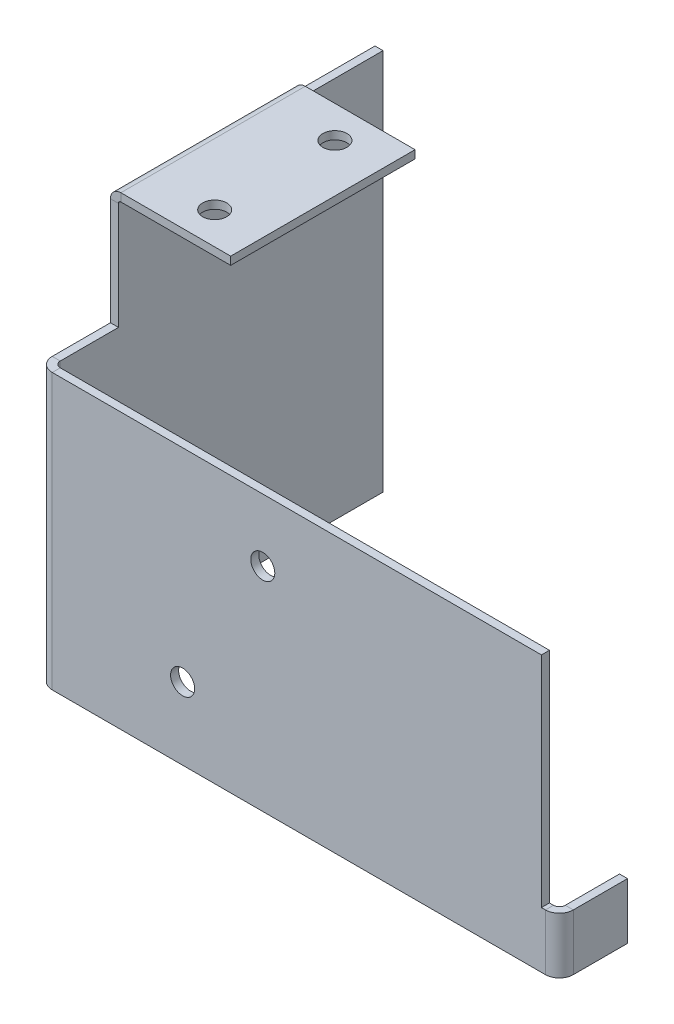
ISO-10303-21;
HEADER;
FILE_DESCRIPTION(('STEP AP214'),'2;1');
FILE_NAME('part.step','',(''),(''),'','','');
FILE_SCHEMA(('AUTOMOTIVE_DESIGN { 1 0 10303 214 1 1 1 1 }'));
ENDSEC;
DATA;
#1=APPLICATION_CONTEXT('core data for automotive mechanical design processes');
#2=APPLICATION_PROTOCOL_DEFINITION('international standard','automotive_design',2000,#1);
#3=PRODUCT_CONTEXT('',#1,'mechanical');
#4=PRODUCT('Part','Part','',(#3));
#5=PRODUCT_RELATED_PRODUCT_CATEGORY('part','',(#4));
#6=PRODUCT_DEFINITION_FORMATION('','',#4);
#7=PRODUCT_DEFINITION_CONTEXT('part definition',#1,'design');
#8=PRODUCT_DEFINITION('design','',#6,#7);
#9=PRODUCT_DEFINITION_SHAPE('','',#8);
#10=(LENGTH_UNIT() NAMED_UNIT(*) SI_UNIT(.MILLI.,.METRE.));
#11=(NAMED_UNIT(*) PLANE_ANGLE_UNIT() SI_UNIT($,.RADIAN.));
#12=(NAMED_UNIT(*) SI_UNIT($,.STERADIAN.) SOLID_ANGLE_UNIT());
#13=UNCERTAINTY_MEASURE_WITH_UNIT(LENGTH_MEASURE(1.E-05),#10,'distance_accuracy_value','');
#14=(GEOMETRIC_REPRESENTATION_CONTEXT(3) GLOBAL_UNCERTAINTY_ASSIGNED_CONTEXT((#13)) GLOBAL_UNIT_ASSIGNED_CONTEXT((#10,
#11,#12)) REPRESENTATION_CONTEXT('',''));
#15=CARTESIAN_POINT('',(0.,0.,0.));
#16=DIRECTION('',(0.,0.,1.));
#17=DIRECTION('',(1.,0.,0.));
#18=AXIS2_PLACEMENT_3D('',#15,#16,#17);
#19=CARTESIAN_POINT('',(50.,-49.0000000000001,32.0000000000002));
#20=DIRECTION('',(0.,1.,0.));
#21=DIRECTION('',(-1.,0.,0.));
#22=AXIS2_PLACEMENT_3D('',#19,#20,#21);
#23=PLANE('',#22);
#24=DIRECTION('',(0.,0.,1.));
#25=VECTOR('',#24,1.);
#26=CARTESIAN_POINT('',(48.2633999999999,-49.0000000000001,31.0000000000002));
#27=LINE('',#26,#25);
#28=CARTESIAN_POINT('',(48.2633999999999,-49.0000000000001,31.0000000000002));
#29=VERTEX_POINT('',#28);
#30=CARTESIAN_POINT('',(48.2634,-49.0000000000001,32.0000000000002));
#31=VERTEX_POINT('',#30);
#32=EDGE_CURVE('E301',#29,#31,#27,.T.);
#33=ORIENTED_EDGE('',*,*,#32,.T.);
#34=DIRECTION('',(1.,0.,0.));
#35=VECTOR('',#34,1.);
#36=CARTESIAN_POINT('',(-2.01358377817448E-13,-49.,32.));
#37=LINE('',#36,#35);
#38=CARTESIAN_POINT('',(-13.2634000000001,-49.,32.));
#39=VERTEX_POINT('',#38);
#40=EDGE_CURVE('E333',#39,#31,#37,.T.);
#41=ORIENTED_EDGE('',*,*,#40,.F.);
#42=DIRECTION('',(0.,0.,-1.));
#43=VECTOR('',#42,1.);
#44=CARTESIAN_POINT('',(-13.2634000000001,-49.,31.));
#45=LINE('',#44,#43);
#46=CARTESIAN_POINT('',(-13.2634000000001,-49.,31.));
#47=VERTEX_POINT('',#46);
#48=EDGE_CURVE('E343',#47,#39,#45,.F.);
#49=ORIENTED_EDGE('',*,*,#48,.F.);
#50=DIRECTION('',(-1.,0.,0.));
#51=VECTOR('',#50,1.);
#52=CARTESIAN_POINT('',(50.,-49.0000000000001,31.0000000000002));
#53=LINE('',#52,#51);
#54=EDGE_CURVE('E337',#47,#29,#53,.F.);
#55=ORIENTED_EDGE('',*,*,#54,.T.);
#56=EDGE_LOOP('',(#33,#41,#49,#55));
#57=FACE_BOUND('',#56,.T.);
#58=ADVANCED_FACE('F104',(#57),#23,.F.);
#59=CARTESIAN_POINT('',(-14.,-14.7,32.));
#60=DIRECTION('',(0.,-1.,0.));
#61=DIRECTION('',(1.,0.,0.));
#62=AXIS2_PLACEMENT_3D('',#59,#60,#61);
#63=PLANE('',#62);
#64=DIRECTION('',(0.,0.,1.));
#65=VECTOR('',#64,1.);
#66=CARTESIAN_POINT('',(47.7634,-14.7000000000001,32.));
#67=LINE('',#66,#65);
#68=CARTESIAN_POINT('',(47.7634,-14.7,31.0000000000002));
#69=VERTEX_POINT('',#68);
#70=CARTESIAN_POINT('',(47.7634,-14.7,32.0000000000002));
#71=VERTEX_POINT('',#70);
#72=EDGE_CURVE('E325',#69,#71,#67,.T.);
#73=ORIENTED_EDGE('',*,*,#72,.F.);
#74=DIRECTION('',(1.,0.,0.));
#75=VECTOR('',#74,1.);
#76=CARTESIAN_POINT('',(-14.,-14.7,31.));
#77=LINE('',#76,#75);
#78=CARTESIAN_POINT('',(-13.2634,-14.7,31.));
#79=VERTEX_POINT('',#78);
#80=EDGE_CURVE('E335',#69,#79,#77,.F.);
#81=ORIENTED_EDGE('',*,*,#80,.T.);
#82=DIRECTION('',(0.,0.,-1.));
#83=VECTOR('',#82,1.);
#84=CARTESIAN_POINT('',(-13.2634,-14.7,32.));
#85=LINE('',#84,#83);
#86=CARTESIAN_POINT('',(-13.2634,-14.7,32.));
#87=VERTEX_POINT('',#86);
#88=EDGE_CURVE('E329',#79,#87,#85,.F.);
#89=ORIENTED_EDGE('',*,*,#88,.T.);
#90=DIRECTION('',(-1.,0.,0.));
#91=VECTOR('',#90,1.);
#92=CARTESIAN_POINT('',(-1.39333882034983E-13,-14.7,32.));
#93=LINE('',#92,#91);
#94=EDGE_CURVE('E330',#71,#87,#93,.T.);
#95=ORIENTED_EDGE('',*,*,#94,.F.);
#96=EDGE_LOOP('',(#73,#81,#89,#95));
#97=FACE_BOUND('',#96,.T.);
#98=ADVANCED_FACE('F507',(#97),#63,.F.);
#99=CARTESIAN_POINT('',(-1.11044336849405E-13,0.,32.));
#100=DIRECTION('',(0.,0.,-1.));
#101=DIRECTION('',(-1.,0.,0.));
#102=AXIS2_PLACEMENT_3D('',#99,#100,#101);
#103=PLANE('',#102);
#104=CARTESIAN_POINT('',(3.,-40.,32.));
#105=DIRECTION('',(0.,0.,1.));
#106=DIRECTION('',(1.,0.,0.));
#107=AXIS2_PLACEMENT_3D('',#104,#105,#106);
#108=CIRCLE('',#107,1.5);
#109=CARTESIAN_POINT('',(4.5,-40.,32.));
#110=VERTEX_POINT('',#109);
#111=EDGE_CURVE('E453',#110,#110,#108,.T.);
#112=ORIENTED_EDGE('',*,*,#111,.F.);
#113=EDGE_LOOP('',(#112));
#114=FACE_BOUND('',#113,.T.);
#115=CARTESIAN_POINT('',(12.9999999999998,-22.5,32.));
#116=DIRECTION('',(0.,0.,1.));
#117=DIRECTION('',(1.,0.,0.));
#118=AXIS2_PLACEMENT_3D('',#115,#116,#117);
#119=CIRCLE('',#118,1.5);
#120=CARTESIAN_POINT('',(14.4999999999998,-22.5,32.));
#121=VERTEX_POINT('',#120);
#122=EDGE_CURVE('E458',#121,#121,#119,.T.);
#123=ORIENTED_EDGE('',*,*,#122,.F.);
#124=EDGE_LOOP('',(#123));
#125=FACE_BOUND('',#124,.T.);
#126=DIRECTION('',(0.,-1.,0.));
#127=VECTOR('',#126,1.);
#128=CARTESIAN_POINT('',(48.2633999999999,-49.0000000000001,32.0000000000002));
#129=LINE('',#128,#127);
#130=CARTESIAN_POINT('',(48.2634,-42.0000000000001,32.0000000000002));
#131=VERTEX_POINT('',#130);
#132=EDGE_CURVE('E294',#31,#131,#129,.F.);
#133=ORIENTED_EDGE('',*,*,#132,.T.);
#134=DIRECTION('',(1.,0.,0.));
#135=VECTOR('',#134,1.);
#136=CARTESIAN_POINT('',(-1.11044336849405E-13,-42.0000000000001,32.));
#137=LINE('',#136,#135);
#138=CARTESIAN_POINT('',(47.7634,-42.0000000000001,32.0000000000002));
#139=VERTEX_POINT('',#138);
#140=EDGE_CURVE('E327',#139,#131,#137,.T.);
#141=ORIENTED_EDGE('',*,*,#140,.F.);
#142=DIRECTION('',(0.,-1.,0.));
#143=VECTOR('',#142,1.);
#144=CARTESIAN_POINT('',(47.7634000000001,0.,32.0000000000002));
#145=LINE('',#144,#143);
#146=EDGE_CURVE('E320',#71,#139,#145,.T.);
#147=ORIENTED_EDGE('',*,*,#146,.F.);
#148=ORIENTED_EDGE('',*,*,#94,.T.);
#149=DIRECTION('',(0.,-1.,0.));
#150=VECTOR('',#149,1.);
#151=CARTESIAN_POINT('',(-13.2634,-14.7000000000001,32.));
#152=LINE('',#151,#150);
#153=EDGE_CURVE('E340',#39,#87,#152,.F.);
#154=ORIENTED_EDGE('',*,*,#153,.F.);
#155=ORIENTED_EDGE('',*,*,#40,.T.);
#156=EDGE_LOOP('',(#133,#141,#147,#148,#154,#155));
#157=FACE_BOUND('',#156,.T.);
#158=ADVANCED_FACE('F491',(#114,#125,#157),#103,.F.);
#159=CARTESIAN_POINT('',(-1.07703701030212E-13,0.,31.));
#160=DIRECTION('',(0.,0.,-1.));
#161=DIRECTION('',(-1.,0.,0.));
#162=AXIS2_PLACEMENT_3D('',#159,#160,#161);
#163=PLANE('',#162);
#164=CARTESIAN_POINT('',(3.,-40.,31.));
#165=DIRECTION('',(0.,0.,-1.));
#166=DIRECTION('',(-1.,0.,0.));
#167=AXIS2_PLACEMENT_3D('',#164,#165,#166);
#168=CIRCLE('',#167,1.5);
#169=CARTESIAN_POINT('',(1.5,-40.,31.));
#170=VERTEX_POINT('',#169);
#171=EDGE_CURVE('E108',#170,#170,#168,.T.);
#172=ORIENTED_EDGE('',*,*,#171,.F.);
#173=EDGE_LOOP('',(#172));
#174=FACE_BOUND('',#173,.T.);
#175=CARTESIAN_POINT('',(12.9999999999998,-22.5,31.0000000000001));
#176=DIRECTION('',(0.,0.,-1.));
#177=DIRECTION('',(-1.,0.,0.));
#178=AXIS2_PLACEMENT_3D('',#175,#176,#177);
#179=CIRCLE('',#178,1.5);
#180=CARTESIAN_POINT('',(11.4999999999998,-22.5,31.0000000000001));
#181=VERTEX_POINT('',#180);
#182=EDGE_CURVE('E451',#181,#181,#179,.T.);
#183=ORIENTED_EDGE('',*,*,#182,.F.);
#184=EDGE_LOOP('',(#183));
#185=FACE_BOUND('',#184,.T.);
#186=DIRECTION('',(-1.,0.,0.));
#187=VECTOR('',#186,1.);
#188=CARTESIAN_POINT('',(48.2634,-42.0000000000001,31.0000000000002));
#189=LINE('',#188,#187);
#190=CARTESIAN_POINT('',(48.2634,-42.0000000000001,31.0000000000002));
#191=VERTEX_POINT('',#190);
#192=CARTESIAN_POINT('',(47.7634,-42.0000000000001,31.0000000000002));
#193=VERTEX_POINT('',#192);
#194=EDGE_CURVE('E121',#191,#193,#189,.T.);
#195=ORIENTED_EDGE('',*,*,#194,.F.);
#196=DIRECTION('',(0.,-1.,0.));
#197=VECTOR('',#196,1.);
#198=CARTESIAN_POINT('',(48.2633999999999,-49.0000000000001,31.0000000000002));
#199=LINE('',#198,#197);
#200=EDGE_CURVE('E307',#29,#191,#199,.F.);
#201=ORIENTED_EDGE('',*,*,#200,.F.);
#202=ORIENTED_EDGE('',*,*,#54,.F.);
#203=DIRECTION('',(0.,-1.,0.));
#204=VECTOR('',#203,1.);
#205=CARTESIAN_POINT('',(-13.2634,-14.7000000000001,31.));
#206=LINE('',#205,#204);
#207=EDGE_CURVE('E346',#79,#47,#206,.T.);
#208=ORIENTED_EDGE('',*,*,#207,.F.);
#209=ORIENTED_EDGE('',*,*,#80,.F.);
#210=DIRECTION('',(0.,1.,0.));
#211=VECTOR('',#210,1.);
#212=CARTESIAN_POINT('',(47.7634,-42.0000000000001,31.0000000000002));
#213=LINE('',#212,#211);
#214=EDGE_CURVE('E321',#193,#69,#213,.T.);
#215=ORIENTED_EDGE('',*,*,#214,.F.);
#216=EDGE_LOOP('',(#195,#201,#202,#208,#209,#215));
#217=FACE_BOUND('',#216,.T.);
#218=ADVANCED_FACE('F499',(#174,#185,#217),#163,.T.);
#219=CARTESIAN_POINT('',(-15.,0.,0.));
#220=DIRECTION('',(-1.,0.,0.));
#221=DIRECTION('',(0.,-1.,0.));
#222=AXIS2_PLACEMENT_3D('',#219,#220,#221);
#223=PLANE('',#222);
#224=DIRECTION('',(0.,0.,-1.));
#225=VECTOR('',#224,1.);
#226=CARTESIAN_POINT('',(-15.0000000000002,-49.,0.));
#227=LINE('',#226,#225);
#228=CARTESIAN_POINT('',(-15.0000000000001,-49.,30.2634));
#229=VERTEX_POINT('',#228);
#230=CARTESIAN_POINT('',(-15.0000000000002,-49.,-10.));
#231=VERTEX_POINT('',#230);
#232=EDGE_CURVE('E393',#229,#231,#227,.T.);
#233=ORIENTED_EDGE('',*,*,#232,.F.);
#234=DIRECTION('',(0.,-1.,0.));
#235=VECTOR('',#234,1.);
#236=CARTESIAN_POINT('',(-15.0000000000001,-49.,30.2634));
#237=LINE('',#236,#235);
#238=CARTESIAN_POINT('',(-15.0000000000002,-14.7,30.2634));
#239=VERTEX_POINT('',#238);
#240=EDGE_CURVE('E350',#229,#239,#237,.F.);
#241=ORIENTED_EDGE('',*,*,#240,.T.);
#242=DIRECTION('',(0.,0.,-1.));
#243=VECTOR('',#242,1.);
#244=CARTESIAN_POINT('',(-15.0000000000002,-14.7,32.));
#245=LINE('',#244,#243);
#246=CARTESIAN_POINT('',(-15.,-14.7,23.));
#247=VERTEX_POINT('',#246);
#248=EDGE_CURVE('E129',#239,#247,#245,.T.);
#249=ORIENTED_EDGE('',*,*,#248,.T.);
#250=DIRECTION('',(0.,-1.,0.));
#251=VECTOR('',#250,1.);
#252=CARTESIAN_POINT('',(-15.0000000000002,-49.,23.));
#253=LINE('',#252,#251);
#254=CARTESIAN_POINT('',(-15.,-1.3,23.));
#255=VERTEX_POINT('',#254);
#256=EDGE_CURVE('E396',#255,#247,#253,.T.);
#257=ORIENTED_EDGE('',*,*,#256,.F.);
#258=DIRECTION('',(0.,0.,-1.));
#259=VECTOR('',#258,1.);
#260=CARTESIAN_POINT('',(-15.,-1.3,0.));
#261=LINE('',#260,#259);
#262=CARTESIAN_POINT('',(-15.,-1.3,0.));
#263=VERTEX_POINT('',#262);
#264=EDGE_CURVE('E403',#255,#263,#261,.T.);
#265=ORIENTED_EDGE('',*,*,#264,.T.);
#266=DIRECTION('',(0.,0.,-1.));
#267=VECTOR('',#266,1.);
#268=CARTESIAN_POINT('',(-15.,-1.3,0.));
#269=LINE('',#268,#267);
#270=CARTESIAN_POINT('',(-15.,-1.3,-10.));
#271=VERTEX_POINT('',#270);
#272=EDGE_CURVE('E377',#263,#271,#269,.T.);
#273=ORIENTED_EDGE('',*,*,#272,.T.);
#274=DIRECTION('',(0.,-1.,0.));
#275=VECTOR('',#274,1.);
#276=CARTESIAN_POINT('',(-15.0000000000002,-49.,-10.));
#277=LINE('',#276,#275);
#278=EDGE_CURVE('E384',#271,#231,#277,.T.);
#279=ORIENTED_EDGE('',*,*,#278,.T.);
#280=EDGE_LOOP('',(#233,#241,#249,#257,#265,#273,#279));
#281=FACE_BOUND('',#280,.T.);
#282=ADVANCED_FACE('F520',(#281),#223,.T.);
#283=CARTESIAN_POINT('',(-14.,0.,0.));
#284=DIRECTION('',(-1.,0.,0.));
#285=DIRECTION('',(0.,-1.,0.));
#286=AXIS2_PLACEMENT_3D('',#283,#284,#285);
#287=PLANE('',#286);
#288=DIRECTION('',(0.,-1.,0.));
#289=VECTOR('',#288,1.);
#290=CARTESIAN_POINT('',(-14.0000000000001,-49.,30.2634));
#291=LINE('',#290,#289);
#292=CARTESIAN_POINT('',(-14.0000000000001,-49.,30.2634));
#293=VERTEX_POINT('',#292);
#294=CARTESIAN_POINT('',(-14.,-14.7,30.2634));
#295=VERTEX_POINT('',#294);
#296=EDGE_CURVE('E362',#293,#295,#291,.F.);
#297=ORIENTED_EDGE('',*,*,#296,.F.);
#298=DIRECTION('',(0.,0.,1.));
#299=VECTOR('',#298,1.);
#300=CARTESIAN_POINT('',(-14.0000000000002,-49.,0.));
#301=LINE('',#300,#299);
#302=CARTESIAN_POINT('',(-14.0000000000002,-49.0000000000002,-10.));
#303=VERTEX_POINT('',#302);
#304=EDGE_CURVE('E398',#293,#303,#301,.F.);
#305=ORIENTED_EDGE('',*,*,#304,.T.);
#306=DIRECTION('',(0.,1.,0.));
#307=VECTOR('',#306,1.);
#308=CARTESIAN_POINT('',(-14.0000000000002,-49.,-10.));
#309=LINE('',#308,#307);
#310=CARTESIAN_POINT('',(-14.,-1.3,-10.));
#311=VERTEX_POINT('',#310);
#312=EDGE_CURVE('E378',#303,#311,#309,.T.);
#313=ORIENTED_EDGE('',*,*,#312,.T.);
#314=DIRECTION('',(0.,0.,1.));
#315=VECTOR('',#314,1.);
#316=CARTESIAN_POINT('',(-14.,-1.3,0.));
#317=LINE('',#316,#315);
#318=CARTESIAN_POINT('',(-14.,-1.3,0.));
#319=VERTEX_POINT('',#318);
#320=EDGE_CURVE('E380',#311,#319,#317,.T.);
#321=ORIENTED_EDGE('',*,*,#320,.T.);
#322=DIRECTION('',(0.,0.,1.));
#323=VECTOR('',#322,1.);
#324=CARTESIAN_POINT('',(-14.,-1.3,23.));
#325=LINE('',#324,#323);
#326=CARTESIAN_POINT('',(-14.,-1.3,23.));
#327=VERTEX_POINT('',#326);
#328=EDGE_CURVE('E409',#327,#319,#325,.F.);
#329=ORIENTED_EDGE('',*,*,#328,.F.);
#330=DIRECTION('',(0.,1.,0.));
#331=VECTOR('',#330,1.);
#332=CARTESIAN_POINT('',(-14.,0.,23.));
#333=LINE('',#332,#331);
#334=CARTESIAN_POINT('',(-14.,-14.7,23.));
#335=VERTEX_POINT('',#334);
#336=EDGE_CURVE('E400',#327,#335,#333,.F.);
#337=ORIENTED_EDGE('',*,*,#336,.T.);
#338=DIRECTION('',(0.,0.,-1.));
#339=VECTOR('',#338,1.);
#340=CARTESIAN_POINT('',(-14.,-14.7,32.));
#341=LINE('',#340,#339);
#342=EDGE_CURVE('E375',#295,#335,#341,.T.);
#343=ORIENTED_EDGE('',*,*,#342,.F.);
#344=EDGE_LOOP('',(#297,#305,#313,#321,#329,#337,#343));
#345=FACE_BOUND('',#344,.T.);
#346=ADVANCED_FACE('F531',(#345),#287,.F.);
#347=CARTESIAN_POINT('',(-15.0000000000002,-49.,0.));
#348=DIRECTION('',(0.,-1.,0.));
#349=DIRECTION('',(1.,0.,0.));
#350=AXIS2_PLACEMENT_3D('',#347,#348,#349);
#351=PLANE('',#350);
#352=ORIENTED_EDGE('',*,*,#304,.F.);
#353=DIRECTION('',(-1.,0.,0.));
#354=VECTOR('',#353,1.);
#355=CARTESIAN_POINT('',(-14.0000000000001,-49.,30.2634));
#356=LINE('',#355,#354);
#357=EDGE_CURVE('E356',#293,#229,#356,.T.);
#358=ORIENTED_EDGE('',*,*,#357,.T.);
#359=ORIENTED_EDGE('',*,*,#232,.T.);
#360=DIRECTION('',(-1.,0.,0.));
#361=VECTOR('',#360,1.);
#362=CARTESIAN_POINT('',(34.7369469704452,-49.0000000000002,-10.));
#363=LINE('',#362,#361);
#364=EDGE_CURVE('E381',#303,#231,#363,.T.);
#365=ORIENTED_EDGE('',*,*,#364,.F.);
#366=EDGE_LOOP('',(#352,#358,#359,#365));
#367=FACE_BOUND('',#366,.T.);
#368=ADVANCED_FACE('F526',(#367),#351,.T.);
#369=CARTESIAN_POINT('',(-15.0000000000002,-14.7,32.));
#370=DIRECTION('',(0.,-1.,0.));
#371=DIRECTION('',(0.,0.,-1.));
#372=AXIS2_PLACEMENT_3D('',#369,#370,#371);
#373=PLANE('',#372);
#374=DIRECTION('',(-1.,0.,0.));
#375=VECTOR('',#374,1.);
#376=CARTESIAN_POINT('',(-14.,-14.7,30.2634));
#377=LINE('',#376,#375);
#378=EDGE_CURVE('E366',#295,#239,#377,.T.);
#379=ORIENTED_EDGE('',*,*,#378,.F.);
#380=ORIENTED_EDGE('',*,*,#342,.T.);
#381=DIRECTION('',(-1.,0.,0.));
#382=VECTOR('',#381,1.);
#383=CARTESIAN_POINT('',(-15.0000000000002,-14.7,23.));
#384=LINE('',#383,#382);
#385=EDGE_CURVE('E369',#335,#247,#384,.T.);
#386=ORIENTED_EDGE('',*,*,#385,.T.);
#387=ORIENTED_EDGE('',*,*,#248,.F.);
#388=EDGE_LOOP('',(#379,#380,#386,#387));
#389=FACE_BOUND('',#388,.T.);
#390=ADVANCED_FACE('F517',(#389),#373,.F.);
#391=CARTESIAN_POINT('',(-15.0000000000002,-49.,23.));
#392=DIRECTION('',(0.,0.,1.));
#393=DIRECTION('',(1.,0.,0.));
#394=AXIS2_PLACEMENT_3D('',#391,#392,#393);
#395=PLANE('',#394);
#396=ORIENTED_EDGE('',*,*,#256,.T.);
#397=ORIENTED_EDGE('',*,*,#385,.F.);
#398=ORIENTED_EDGE('',*,*,#336,.F.);
#399=DIRECTION('',(-1.,0.,0.));
#400=VECTOR('',#399,1.);
#401=CARTESIAN_POINT('',(-15.,-1.29999999999999,23.));
#402=LINE('',#401,#400);
#403=EDGE_CURVE('E392',#327,#255,#402,.T.);
#404=ORIENTED_EDGE('',*,*,#403,.T.);
#405=EDGE_LOOP('',(#396,#397,#398,#404));
#406=FACE_BOUND('',#405,.T.);
#407=ADVANCED_FACE('F545',(#406),#395,.T.);
#408=CARTESIAN_POINT('',(0.,-1.,0.));
#409=DIRECTION('',(0.,0.,-1.));
#410=DIRECTION('',(-1.,0.,0.));
#411=AXIS2_PLACEMENT_3D('',#408,#409,#410);
#412=PLANE('',#411);
#413=DIRECTION('',(-1.,0.,0.));
#414=VECTOR('',#413,1.);
#415=CARTESIAN_POINT('',(0.,-1.,0.));
#416=LINE('',#415,#414);
#417=CARTESIAN_POINT('',(0.,-1.,0.));
#418=VERTEX_POINT('',#417);
#419=CARTESIAN_POINT('',(-13.7,-1.,0.));
#420=VERTEX_POINT('',#419);
#421=EDGE_CURVE('E439',#418,#420,#416,.T.);
#422=ORIENTED_EDGE('',*,*,#421,.T.);
#423=DIRECTION('',(0.,1.,0.));
#424=VECTOR('',#423,1.);
#425=CARTESIAN_POINT('',(-13.7,-1.,0.));
#426=LINE('',#425,#424);
#427=CARTESIAN_POINT('',(-13.7,0.,0.));
#428=VERTEX_POINT('',#427);
#429=EDGE_CURVE('E420',#420,#428,#426,.T.);
#430=ORIENTED_EDGE('',*,*,#429,.T.);
#431=DIRECTION('',(-1.,0.,0.));
#432=VECTOR('',#431,1.);
#433=CARTESIAN_POINT('',(0.,0.,0.));
#434=LINE('',#433,#432);
#435=CARTESIAN_POINT('',(0.,0.,0.));
#436=VERTEX_POINT('',#435);
#437=EDGE_CURVE('E447',#436,#428,#434,.T.);
#438=ORIENTED_EDGE('',*,*,#437,.F.);
#439=DIRECTION('',(0.,1.,0.));
#440=VECTOR('',#439,1.);
#441=CARTESIAN_POINT('',(0.,-1.,0.));
#442=LINE('',#441,#440);
#443=EDGE_CURVE('E113',#418,#436,#442,.T.);
#444=ORIENTED_EDGE('',*,*,#443,.F.);
#445=EDGE_LOOP('',(#422,#430,#438,#444));
#446=FACE_BOUND('',#445,.T.);
#447=ADVANCED_FACE('F569',(#446),#412,.T.);
#448=CARTESIAN_POINT('',(0.,-1.,0.));
#449=DIRECTION('',(0.,-1.,0.));
#450=DIRECTION('',(0.,0.,-1.));
#451=AXIS2_PLACEMENT_3D('',#448,#449,#450);
#452=PLANE('',#451);
#453=CARTESIAN_POINT('',(-6.,-0.999999999999999,4.));
#454=DIRECTION('',(0.,-1.,0.));
#455=DIRECTION('',(0.,0.,-1.));
#456=AXIS2_PLACEMENT_3D('',#453,#454,#455);
#457=CIRCLE('',#456,1.5);
#458=CARTESIAN_POINT('',(-6.,-0.999999999999999,2.5));
#459=VERTEX_POINT('',#458);
#460=EDGE_CURVE('E463',#459,#459,#457,.T.);
#461=ORIENTED_EDGE('',*,*,#460,.F.);
#462=EDGE_LOOP('',(#461));
#463=FACE_BOUND('',#462,.T.);
#464=CARTESIAN_POINT('',(-6.,-0.999999999999999,19.));
#465=DIRECTION('',(0.,-1.,0.));
#466=DIRECTION('',(0.,0.,-1.));
#467=AXIS2_PLACEMENT_3D('',#464,#465,#466);
#468=CIRCLE('',#467,1.5);
#469=CARTESIAN_POINT('',(-6.,-0.999999999999999,17.5));
#470=VERTEX_POINT('',#469);
#471=EDGE_CURVE('E1076',#470,#470,#468,.T.);
#472=ORIENTED_EDGE('',*,*,#471,.F.);
#473=EDGE_LOOP('',(#472));
#474=FACE_BOUND('',#473,.T.);
#475=DIRECTION('',(1.,0.,0.));
#476=VECTOR('',#475,1.);
#477=CARTESIAN_POINT('',(0.,-1.,23.));
#478=LINE('',#477,#476);
#479=CARTESIAN_POINT('',(-13.7,-1.,23.));
#480=VERTEX_POINT('',#479);
#481=CARTESIAN_POINT('',(0.,-1.,23.));
#482=VERTEX_POINT('',#481);
#483=EDGE_CURVE('E443',#480,#482,#478,.T.);
#484=ORIENTED_EDGE('',*,*,#483,.F.);
#485=DIRECTION('',(0.,0.,-1.));
#486=VECTOR('',#485,1.);
#487=CARTESIAN_POINT('',(-13.7,-1.,0.));
#488=LINE('',#487,#486);
#489=EDGE_CURVE('E426',#420,#480,#488,.F.);
#490=ORIENTED_EDGE('',*,*,#489,.F.);
#491=ORIENTED_EDGE('',*,*,#421,.F.);
#492=DIRECTION('',(0.,0.,-1.));
#493=VECTOR('',#492,1.);
#494=CARTESIAN_POINT('',(0.,-1.,0.));
#495=LINE('',#494,#493);
#496=EDGE_CURVE('E436',#482,#418,#495,.T.);
#497=ORIENTED_EDGE('',*,*,#496,.F.);
#498=EDGE_LOOP('',(#484,#490,#491,#497));
#499=FACE_BOUND('',#498,.T.);
#500=ADVANCED_FACE('F561',(#463,#474,#499),#452,.T.);
#501=CARTESIAN_POINT('',(0.,0.,0.));
#502=DIRECTION('',(0.,-1.,0.));
#503=DIRECTION('',(0.,0.,-1.));
#504=AXIS2_PLACEMENT_3D('',#501,#502,#503);
#505=PLANE('',#504);
#506=CARTESIAN_POINT('',(-6.,0.,4.));
#507=DIRECTION('',(0.,1.,0.));
#508=DIRECTION('',(0.,0.,1.));
#509=AXIS2_PLACEMENT_3D('',#506,#507,#508);
#510=CIRCLE('',#509,1.5);
#511=CARTESIAN_POINT('',(-6.,0.,5.5));
#512=VERTEX_POINT('',#511);
#513=EDGE_CURVE('E1075',#512,#512,#510,.T.);
#514=ORIENTED_EDGE('',*,*,#513,.F.);
#515=EDGE_LOOP('',(#514));
#516=FACE_BOUND('',#515,.T.);
#517=CARTESIAN_POINT('',(-6.,0.,19.));
#518=DIRECTION('',(0.,1.,0.));
#519=DIRECTION('',(0.,0.,1.));
#520=AXIS2_PLACEMENT_3D('',#517,#518,#519);
#521=CIRCLE('',#520,1.5);
#522=CARTESIAN_POINT('',(-6.,0.,20.5));
#523=VERTEX_POINT('',#522);
#524=EDGE_CURVE('E1077',#523,#523,#521,.T.);
#525=ORIENTED_EDGE('',*,*,#524,.F.);
#526=EDGE_LOOP('',(#525));
#527=FACE_BOUND('',#526,.T.);
#528=DIRECTION('',(0.,0.,-1.));
#529=VECTOR('',#528,1.);
#530=CARTESIAN_POINT('',(-13.7,0.,0.));
#531=LINE('',#530,#529);
#532=CARTESIAN_POINT('',(-13.7,0.,23.));
#533=VERTEX_POINT('',#532);
#534=EDGE_CURVE('E414',#428,#533,#531,.F.);
#535=ORIENTED_EDGE('',*,*,#534,.T.);
#536=DIRECTION('',(1.,0.,0.));
#537=VECTOR('',#536,1.);
#538=CARTESIAN_POINT('',(0.,0.,23.));
#539=LINE('',#538,#537);
#540=CARTESIAN_POINT('',(0.,0.,23.));
#541=VERTEX_POINT('',#540);
#542=EDGE_CURVE('E440',#533,#541,#539,.T.);
#543=ORIENTED_EDGE('',*,*,#542,.T.);
#544=DIRECTION('',(0.,0.,-1.));
#545=VECTOR('',#544,1.);
#546=CARTESIAN_POINT('',(0.,0.,0.));
#547=LINE('',#546,#545);
#548=EDGE_CURVE('E434',#541,#436,#547,.T.);
#549=ORIENTED_EDGE('',*,*,#548,.T.);
#550=ORIENTED_EDGE('',*,*,#437,.T.);
#551=EDGE_LOOP('',(#535,#543,#549,#550));
#552=FACE_BOUND('',#551,.T.);
#553=ADVANCED_FACE('F571',(#516,#527,#552),#505,.F.);
#554=CARTESIAN_POINT('',(0.,-1.,0.));
#555=DIRECTION('',(1.,0.,0.));
#556=DIRECTION('',(0.,0.,-1.));
#557=AXIS2_PLACEMENT_3D('',#554,#555,#556);
#558=PLANE('',#557);
#559=ORIENTED_EDGE('',*,*,#548,.F.);
#560=DIRECTION('',(0.,1.,0.));
#561=VECTOR('',#560,1.);
#562=CARTESIAN_POINT('',(0.,-1.,23.));
#563=LINE('',#562,#561);
#564=EDGE_CURVE('E13',#482,#541,#563,.T.);
#565=ORIENTED_EDGE('',*,*,#564,.F.);
#566=ORIENTED_EDGE('',*,*,#496,.T.);
#567=ORIENTED_EDGE('',*,*,#443,.T.);
#568=EDGE_LOOP('',(#559,#565,#566,#567));
#569=FACE_BOUND('',#568,.T.);
#570=ADVANCED_FACE('F106',(#569),#558,.T.);
#571=CARTESIAN_POINT('',(0.,-1.,23.));
#572=DIRECTION('',(0.,0.,1.));
#573=DIRECTION('',(1.,0.,0.));
#574=AXIS2_PLACEMENT_3D('',#571,#572,#573);
#575=PLANE('',#574);
#576=DIRECTION('',(0.,1.,0.));
#577=VECTOR('',#576,1.);
#578=CARTESIAN_POINT('',(-13.7,-1.,23.));
#579=LINE('',#578,#577);
#580=EDGE_CURVE('E431',#480,#533,#579,.T.);
#581=ORIENTED_EDGE('',*,*,#580,.F.);
#582=ORIENTED_EDGE('',*,*,#483,.T.);
#583=ORIENTED_EDGE('',*,*,#564,.T.);
#584=ORIENTED_EDGE('',*,*,#542,.F.);
#585=EDGE_LOOP('',(#581,#582,#583,#584));
#586=FACE_BOUND('',#585,.T.);
#587=ADVANCED_FACE('F557',(#586),#575,.T.);
#588=CARTESIAN_POINT('',(-13.7,-1.3,23.));
#589=DIRECTION('',(0.,0.,1.));
#590=DIRECTION('',(1.,0.,0.));
#591=AXIS2_PLACEMENT_3D('',#588,#589,#590);
#592=PLANE('',#591);
#593=ORIENTED_EDGE('',*,*,#403,.F.);
#594=CARTESIAN_POINT('',(-13.7,-1.3,23.));
#595=DIRECTION('',(0.,0.,-1.));
#596=DIRECTION('',(-1.,0.,0.));
#597=AXIS2_PLACEMENT_3D('',#594,#595,#596);
#598=CIRCLE('',#597,0.299999999999998);
#599=EDGE_CURVE('E423',#480,#327,#598,.F.);
#600=ORIENTED_EDGE('',*,*,#599,.F.);
#601=ORIENTED_EDGE('',*,*,#580,.T.);
#602=CARTESIAN_POINT('',(-13.7,-1.3,23.));
#603=DIRECTION('',(0.,0.,-1.));
#604=DIRECTION('',(-1.,0.,0.));
#605=AXIS2_PLACEMENT_3D('',#602,#603,#604);
#606=CIRCLE('',#605,1.3);
#607=EDGE_CURVE('E416',#533,#255,#606,.F.);
#608=ORIENTED_EDGE('',*,*,#607,.T.);
#609=EDGE_LOOP('',(#593,#600,#601,#608));
#610=FACE_BOUND('',#609,.T.);
#611=ADVANCED_FACE('F552',(#610),#592,.T.);
#612=CARTESIAN_POINT('',(-13.7,-1.3,0.));
#613=DIRECTION('',(0.,0.,1.));
#614=DIRECTION('',(1.,0.,0.));
#615=AXIS2_PLACEMENT_3D('',#612,#613,#614);
#616=PLANE('',#615);
#617=CARTESIAN_POINT('',(-13.7,-1.3,0.));
#618=DIRECTION('',(0.,0.,-1.));
#619=DIRECTION('',(-1.,0.,0.));
#620=AXIS2_PLACEMENT_3D('',#617,#618,#619);
#621=CIRCLE('',#620,0.299999999999998);
#622=EDGE_CURVE('E395',#319,#420,#621,.T.);
#623=ORIENTED_EDGE('',*,*,#622,.F.);
#624=DIRECTION('',(-1.,0.,0.));
#625=VECTOR('',#624,1.);
#626=CARTESIAN_POINT('',(-14.,-1.3,0.));
#627=LINE('',#626,#625);
#628=EDGE_CURVE('E406',#319,#263,#627,.T.);
#629=ORIENTED_EDGE('',*,*,#628,.T.);
#630=CARTESIAN_POINT('',(-13.7,-1.3,0.));
#631=DIRECTION('',(0.,0.,-1.));
#632=DIRECTION('',(-1.,0.,0.));
#633=AXIS2_PLACEMENT_3D('',#630,#631,#632);
#634=CIRCLE('',#633,1.3);
#635=EDGE_CURVE('E417',#263,#428,#634,.T.);
#636=ORIENTED_EDGE('',*,*,#635,.T.);
#637=ORIENTED_EDGE('',*,*,#429,.F.);
#638=EDGE_LOOP('',(#623,#629,#636,#637));
#639=FACE_BOUND('',#638,.T.);
#640=ADVANCED_FACE('F566',(#639),#616,.F.);
#641=CARTESIAN_POINT('',(-13.7,-1.3,0.));
#642=DIRECTION('',(0.,0.,-1.));
#643=DIRECTION('',(-1.,0.,0.));
#644=AXIS2_PLACEMENT_3D('',#641,#642,#643);
#645=CYLINDRICAL_SURFACE('',#644,1.3);
#646=ORIENTED_EDGE('',*,*,#534,.F.);
#647=ORIENTED_EDGE('',*,*,#635,.F.);
#648=ORIENTED_EDGE('',*,*,#264,.F.);
#649=ORIENTED_EDGE('',*,*,#607,.F.);
#650=EDGE_LOOP('',(#646,#647,#648,#649));
#651=FACE_BOUND('',#650,.T.);
#652=ADVANCED_FACE('F550',(#651),#645,.T.);
#653=CARTESIAN_POINT('',(-13.7,-1.3,0.));
#654=DIRECTION('',(0.,0.,-1.));
#655=DIRECTION('',(-1.,0.,0.));
#656=AXIS2_PLACEMENT_3D('',#653,#654,#655);
#657=CYLINDRICAL_SURFACE('',#656,0.299999999999998);
#658=ORIENTED_EDGE('',*,*,#489,.T.);
#659=ORIENTED_EDGE('',*,*,#599,.T.);
#660=ORIENTED_EDGE('',*,*,#328,.T.);
#661=ORIENTED_EDGE('',*,*,#622,.T.);
#662=EDGE_LOOP('',(#658,#659,#660,#661));
#663=FACE_BOUND('',#662,.T.);
#664=ADVANCED_FACE('F563',(#663),#657,.F.);
#665=CARTESIAN_POINT('',(34.7369469704452,-49.0000000000002,-10.));
#666=DIRECTION('',(0.,0.,-1.));
#667=DIRECTION('',(-1.,0.,0.));
#668=AXIS2_PLACEMENT_3D('',#665,#666,#667);
#669=PLANE('',#668);
#670=ORIENTED_EDGE('',*,*,#312,.F.);
#671=ORIENTED_EDGE('',*,*,#364,.T.);
#672=ORIENTED_EDGE('',*,*,#278,.F.);
#673=DIRECTION('',(-1.,0.,0.));
#674=VECTOR('',#673,1.);
#675=CARTESIAN_POINT('',(34.7369469704453,-1.30000000000017,-10.));
#676=LINE('',#675,#674);
#677=EDGE_CURVE('E387',#311,#271,#676,.T.);
#678=ORIENTED_EDGE('',*,*,#677,.F.);
#679=EDGE_LOOP('',(#670,#671,#672,#678));
#680=FACE_BOUND('',#679,.T.);
#681=ADVANCED_FACE('F534',(#680),#669,.T.);
#682=CARTESIAN_POINT('',(34.7369469704453,-1.30000000000017,0.));
#683=DIRECTION('',(0.,1.,0.));
#684=DIRECTION('',(-1.,0.,0.));
#685=AXIS2_PLACEMENT_3D('',#682,#683,#684);
#686=PLANE('',#685);
#687=ORIENTED_EDGE('',*,*,#320,.F.);
#688=ORIENTED_EDGE('',*,*,#677,.T.);
#689=ORIENTED_EDGE('',*,*,#272,.F.);
#690=ORIENTED_EDGE('',*,*,#628,.F.);
#691=EDGE_LOOP('',(#687,#688,#689,#690));
#692=FACE_BOUND('',#691,.T.);
#693=ADVANCED_FACE('F539',(#692),#686,.T.);
#694=CARTESIAN_POINT('',(-13.2634,-14.7,30.2634));
#695=DIRECTION('',(0.,1.,0.));
#696=DIRECTION('',(-1.,0.,0.));
#697=AXIS2_PLACEMENT_3D('',#694,#695,#696);
#698=PLANE('',#697);
#699=ORIENTED_EDGE('',*,*,#88,.F.);
#700=CARTESIAN_POINT('',(-13.2634,-14.7,30.2634));
#701=DIRECTION('',(0.,-1.,0.));
#702=DIRECTION('',(1.,0.,0.));
#703=AXIS2_PLACEMENT_3D('',#700,#701,#702);
#704=CIRCLE('',#703,0.7366);
#705=EDGE_CURVE('E359',#295,#79,#704,.F.);
#706=ORIENTED_EDGE('',*,*,#705,.F.);
#707=ORIENTED_EDGE('',*,*,#378,.T.);
#708=CARTESIAN_POINT('',(-13.2634,-14.7,30.2634));
#709=DIRECTION('',(0.,-1.,0.));
#710=DIRECTION('',(1.,0.,0.));
#711=AXIS2_PLACEMENT_3D('',#708,#709,#710);
#712=CIRCLE('',#711,1.7366);
#713=EDGE_CURVE('E352',#239,#87,#712,.F.);
#714=ORIENTED_EDGE('',*,*,#713,.T.);
#715=EDGE_LOOP('',(#699,#706,#707,#714));
#716=FACE_BOUND('',#715,.T.);
#717=ADVANCED_FACE('F512',(#716),#698,.T.);
#718=CARTESIAN_POINT('',(-13.2634000000001,-49.,30.2634));
#719=DIRECTION('',(0.,1.,0.));
#720=DIRECTION('',(-1.,0.,0.));
#721=AXIS2_PLACEMENT_3D('',#718,#719,#720);
#722=PLANE('',#721);
#723=CARTESIAN_POINT('',(-13.2634000000001,-49.,30.2634));
#724=DIRECTION('',(0.,-1.,0.));
#725=DIRECTION('',(1.,0.,0.));
#726=AXIS2_PLACEMENT_3D('',#723,#724,#725);
#727=CIRCLE('',#726,0.7366);
#728=EDGE_CURVE('E332',#47,#293,#727,.T.);
#729=ORIENTED_EDGE('',*,*,#728,.F.);
#730=ORIENTED_EDGE('',*,*,#48,.T.);
#731=CARTESIAN_POINT('',(-13.2634000000001,-49.,30.2634));
#732=DIRECTION('',(0.,-1.,0.));
#733=DIRECTION('',(1.,0.,0.));
#734=AXIS2_PLACEMENT_3D('',#731,#732,#733);
#735=CIRCLE('',#734,1.7366);
#736=EDGE_CURVE('E353',#39,#229,#735,.T.);
#737=ORIENTED_EDGE('',*,*,#736,.T.);
#738=ORIENTED_EDGE('',*,*,#357,.F.);
#739=EDGE_LOOP('',(#729,#730,#737,#738));
#740=FACE_BOUND('',#739,.T.);
#741=ADVANCED_FACE('F523',(#740),#722,.F.);
#742=CARTESIAN_POINT('',(-13.2634000000001,-49.,30.2634));
#743=DIRECTION('',(0.,-1.,0.));
#744=DIRECTION('',(0.,0.,1.));
#745=AXIS2_PLACEMENT_3D('',#742,#743,#744);
#746=CYLINDRICAL_SURFACE('',#745,1.7366);
#747=ORIENTED_EDGE('',*,*,#240,.F.);
#748=ORIENTED_EDGE('',*,*,#736,.F.);
#749=ORIENTED_EDGE('',*,*,#153,.T.);
#750=ORIENTED_EDGE('',*,*,#713,.F.);
#751=EDGE_LOOP('',(#747,#748,#749,#750));
#752=FACE_BOUND('',#751,.T.);
#753=ADVANCED_FACE('F510',(#752),#746,.T.);
#754=CARTESIAN_POINT('',(-13.2634000000001,-49.,30.2634));
#755=DIRECTION('',(0.,-1.,0.));
#756=DIRECTION('',(0.,0.,1.));
#757=AXIS2_PLACEMENT_3D('',#754,#755,#756);
#758=CYLINDRICAL_SURFACE('',#757,0.7366);
#759=ORIENTED_EDGE('',*,*,#296,.T.);
#760=ORIENTED_EDGE('',*,*,#705,.T.);
#761=ORIENTED_EDGE('',*,*,#207,.T.);
#762=ORIENTED_EDGE('',*,*,#728,.T.);
#763=EDGE_LOOP('',(#759,#760,#761,#762));
#764=FACE_BOUND('',#763,.T.);
#765=ADVANCED_FACE('F592',(#764),#758,.F.);
#766=CARTESIAN_POINT('',(48.2634,-42.0000000000001,31.0000000000002));
#767=DIRECTION('',(0.,1.,0.));
#768=DIRECTION('',(0.,0.,1.));
#769=AXIS2_PLACEMENT_3D('',#766,#767,#768);
#770=PLANE('',#769);
#771=DIRECTION('',(0.,0.,1.));
#772=VECTOR('',#771,1.);
#773=CARTESIAN_POINT('',(47.7634,-42.0000000000001,31.0000000000002));
#774=LINE('',#773,#772);
#775=EDGE_CURVE('E316',#193,#139,#774,.T.);
#776=ORIENTED_EDGE('',*,*,#775,.T.);
#777=ORIENTED_EDGE('',*,*,#140,.T.);
#778=DIRECTION('',(0.,0.,1.));
#779=VECTOR('',#778,1.);
#780=CARTESIAN_POINT('',(48.2634,-42.0000000000001,31.0000000000002));
#781=LINE('',#780,#779);
#782=EDGE_CURVE('E313',#191,#131,#781,.T.);
#783=ORIENTED_EDGE('',*,*,#782,.F.);
#784=ORIENTED_EDGE('',*,*,#194,.T.);
#785=EDGE_LOOP('',(#776,#777,#783,#784));
#786=FACE_BOUND('',#785,.T.);
#787=ADVANCED_FACE('F496',(#786),#770,.T.);
#788=CARTESIAN_POINT('',(47.7634,-42.0000000000001,31.0000000000002));
#789=DIRECTION('',(1.,0.,0.));
#790=DIRECTION('',(0.,1.,0.));
#791=AXIS2_PLACEMENT_3D('',#788,#789,#790);
#792=PLANE('',#791);
#793=ORIENTED_EDGE('',*,*,#214,.T.);
#794=ORIENTED_EDGE('',*,*,#72,.T.);
#795=ORIENTED_EDGE('',*,*,#146,.T.);
#796=ORIENTED_EDGE('',*,*,#775,.F.);
#797=EDGE_LOOP('',(#793,#794,#795,#796));
#798=FACE_BOUND('',#797,.T.);
#799=ADVANCED_FACE('F504',(#798),#792,.T.);
#800=CARTESIAN_POINT('',(48.2634,-42.0000000000001,30.2634000000002));
#801=DIRECTION('',(0.,1.,0.));
#802=DIRECTION('',(-1.,0.,0.));
#803=AXIS2_PLACEMENT_3D('',#800,#801,#802);
#804=PLANE('',#803);
#805=DIRECTION('',(-1.,0.,0.));
#806=VECTOR('',#805,1.);
#807=CARTESIAN_POINT('',(50.,-42.0000000000001,30.2634000000002));
#808=LINE('',#807,#806);
#809=CARTESIAN_POINT('',(49.,-42.0000000000001,30.2634000000002));
#810=VERTEX_POINT('',#809);
#811=CARTESIAN_POINT('',(50.,-42.0000000000001,30.2634000000002));
#812=VERTEX_POINT('',#811);
#813=EDGE_CURVE('E276',#810,#812,#808,.F.);
#814=ORIENTED_EDGE('',*,*,#813,.F.);
#815=CARTESIAN_POINT('',(48.2634,-42.0000000000001,30.2634000000002));
#816=DIRECTION('',(0.,-1.,0.));
#817=DIRECTION('',(1.,0.,0.));
#818=AXIS2_PLACEMENT_3D('',#815,#816,#817);
#819=CIRCLE('',#818,0.736599999999983);
#820=EDGE_CURVE('E304',#191,#810,#819,.F.);
#821=ORIENTED_EDGE('',*,*,#820,.F.);
#822=ORIENTED_EDGE('',*,*,#782,.T.);
#823=CARTESIAN_POINT('',(48.2634,-42.0000000000001,30.2634000000002));
#824=DIRECTION('',(0.,-1.,0.));
#825=DIRECTION('',(1.,0.,0.));
#826=AXIS2_PLACEMENT_3D('',#823,#824,#825);
#827=CIRCLE('',#826,1.73659999999998);
#828=EDGE_CURVE('E297',#131,#812,#827,.F.);
#829=ORIENTED_EDGE('',*,*,#828,.T.);
#830=EDGE_LOOP('',(#814,#821,#822,#829));
#831=FACE_BOUND('',#830,.T.);
#832=ADVANCED_FACE('F495',(#831),#804,.T.);
#833=CARTESIAN_POINT('',(48.2633999999999,-49.0000000000001,30.2634000000002));
#834=DIRECTION('',(0.,1.,0.));
#835=DIRECTION('',(-1.,0.,0.));
#836=AXIS2_PLACEMENT_3D('',#833,#834,#835);
#837=PLANE('',#836);
#838=CARTESIAN_POINT('',(48.2633999999999,-49.0000000000001,30.2634000000002));
#839=DIRECTION('',(0.,-1.,0.));
#840=DIRECTION('',(1.,0.,0.));
#841=AXIS2_PLACEMENT_3D('',#838,#839,#840);
#842=CIRCLE('',#841,0.736599999999983);
#843=CARTESIAN_POINT('',(48.9999999999999,-49.0000000000001,30.2634000000002));
#844=VERTEX_POINT('',#843);
#845=EDGE_CURVE('E310',#844,#29,#842,.T.);
#846=ORIENTED_EDGE('',*,*,#845,.F.);
#847=DIRECTION('',(-1.,0.,0.));
#848=VECTOR('',#847,1.);
#849=CARTESIAN_POINT('',(48.9999999999999,-49.0000000000001,30.2634000000002));
#850=LINE('',#849,#848);
#851=CARTESIAN_POINT('',(50.,-49.0000000000001,30.2634000000002));
#852=VERTEX_POINT('',#851);
#853=EDGE_CURVE('E288',#844,#852,#850,.F.);
#854=ORIENTED_EDGE('',*,*,#853,.T.);
#855=CARTESIAN_POINT('',(48.2633999999999,-49.0000000000001,30.2634000000002));
#856=DIRECTION('',(0.,-1.,0.));
#857=DIRECTION('',(1.,0.,0.));
#858=AXIS2_PLACEMENT_3D('',#855,#856,#857);
#859=CIRCLE('',#858,1.73659999999998);
#860=EDGE_CURVE('E298',#852,#31,#859,.T.);
#861=ORIENTED_EDGE('',*,*,#860,.T.);
#862=ORIENTED_EDGE('',*,*,#32,.F.);
#863=EDGE_LOOP('',(#846,#854,#861,#862));
#864=FACE_BOUND('',#863,.T.);
#865=ADVANCED_FACE('F480',(#864),#837,.F.);
#866=CARTESIAN_POINT('',(48.2633999999999,-49.0000000000001,30.2634000000002));
#867=DIRECTION('',(0.,-1.,0.));
#868=DIRECTION('',(1.,0.,0.));
#869=AXIS2_PLACEMENT_3D('',#866,#867,#868);
#870=CYLINDRICAL_SURFACE('',#869,1.73659999999998);
#871=ORIENTED_EDGE('',*,*,#132,.F.);
#872=ORIENTED_EDGE('',*,*,#860,.F.);
#873=DIRECTION('',(0.,-1.,0.));
#874=VECTOR('',#873,1.);
#875=CARTESIAN_POINT('',(50.,-42.0000000000001,30.2634000000002));
#876=LINE('',#875,#874);
#877=EDGE_CURVE('E286',#852,#812,#876,.F.);
#878=ORIENTED_EDGE('',*,*,#877,.T.);
#879=ORIENTED_EDGE('',*,*,#828,.F.);
#880=EDGE_LOOP('',(#871,#872,#878,#879));
#881=FACE_BOUND('',#880,.T.);
#882=ADVANCED_FACE('F488',(#881),#870,.T.);
#883=CARTESIAN_POINT('',(48.2633999999999,-49.0000000000001,30.2634000000002));
#884=DIRECTION('',(0.,-1.,0.));
#885=DIRECTION('',(1.,0.,0.));
#886=AXIS2_PLACEMENT_3D('',#883,#884,#885);
#887=CYLINDRICAL_SURFACE('',#886,0.736599999999983);
#888=ORIENTED_EDGE('',*,*,#200,.T.);
#889=ORIENTED_EDGE('',*,*,#820,.T.);
#890=DIRECTION('',(0.,-1.,0.));
#891=VECTOR('',#890,1.);
#892=CARTESIAN_POINT('',(49.,-42.0000000000001,30.2634000000002));
#893=LINE('',#892,#891);
#894=EDGE_CURVE('E291',#810,#844,#893,.T.);
#895=ORIENTED_EDGE('',*,*,#894,.T.);
#896=ORIENTED_EDGE('',*,*,#845,.T.);
#897=EDGE_LOOP('',(#888,#889,#895,#896));
#898=FACE_BOUND('',#897,.T.);
#899=ADVANCED_FACE('F476',(#898),#887,.F.);
#900=CARTESIAN_POINT('',(50.,-49.0000000000001,23.5000000000002));
#901=DIRECTION('',(0.,1.,0.));
#902=DIRECTION('',(0.,0.,1.));
#903=AXIS2_PLACEMENT_3D('',#900,#901,#902);
#904=PLANE('',#903);
#905=ORIENTED_EDGE('',*,*,#853,.F.);
#906=DIRECTION('',(0.,0.,1.));
#907=VECTOR('',#906,1.);
#908=CARTESIAN_POINT('',(49.,-49.0000000000001,23.5000000000002));
#909=LINE('',#908,#907);
#910=CARTESIAN_POINT('',(49.,-49.0000000000001,23.5000000000002));
#911=VERTEX_POINT('',#910);
#912=EDGE_CURVE('E284',#844,#911,#909,.F.);
#913=ORIENTED_EDGE('',*,*,#912,.T.);
#914=DIRECTION('',(-1.,0.,0.));
#915=VECTOR('',#914,1.);
#916=CARTESIAN_POINT('',(50.,-49.0000000000001,23.5000000000002));
#917=LINE('',#916,#915);
#918=CARTESIAN_POINT('',(50.,-49.0000000000001,23.5000000000002));
#919=VERTEX_POINT('',#918);
#920=EDGE_CURVE('E272',#919,#911,#917,.T.);
#921=ORIENTED_EDGE('',*,*,#920,.F.);
#922=DIRECTION('',(0.,0.,-1.));
#923=VECTOR('',#922,1.);
#924=CARTESIAN_POINT('',(50.0000000000001,-49.0000000000001,2.36638316510127E-13));
#925=LINE('',#924,#923);
#926=EDGE_CURVE('E259',#852,#919,#925,.T.);
#927=ORIENTED_EDGE('',*,*,#926,.F.);
#928=EDGE_LOOP('',(#905,#913,#921,#927));
#929=FACE_BOUND('',#928,.T.);
#930=ADVANCED_FACE('F469',(#929),#904,.F.);
#931=CARTESIAN_POINT('',(50.,-42.0000000000001,31.0000000000002));
#932=DIRECTION('',(0.,-1.,0.));
#933=DIRECTION('',(1.,0.,0.));
#934=AXIS2_PLACEMENT_3D('',#931,#932,#933);
#935=PLANE('',#934);
#936=ORIENTED_EDGE('',*,*,#813,.T.);
#937=DIRECTION('',(0.,0.,1.));
#938=VECTOR('',#937,1.);
#939=CARTESIAN_POINT('',(50.0000000000002,-42.0000000000001,3.27306530187848E-13));
#940=LINE('',#939,#938);
#941=CARTESIAN_POINT('',(50.,-42.0000000000001,23.5000000000002));
#942=VERTEX_POINT('',#941);
#943=EDGE_CURVE('E257',#942,#812,#940,.T.);
#944=ORIENTED_EDGE('',*,*,#943,.F.);
#945=DIRECTION('',(-1.,0.,0.));
#946=VECTOR('',#945,1.);
#947=CARTESIAN_POINT('',(50.,-42.0000000000001,23.5000000000002));
#948=LINE('',#947,#946);
#949=CARTESIAN_POINT('',(49.,-42.0000000000001,23.5000000000002));
#950=VERTEX_POINT('',#949);
#951=EDGE_CURVE('E265',#942,#950,#948,.T.);
#952=ORIENTED_EDGE('',*,*,#951,.T.);
#953=DIRECTION('',(0.,0.,-1.));
#954=VECTOR('',#953,1.);
#955=CARTESIAN_POINT('',(49.,-42.0000000000001,31.0000000000002));
#956=LINE('',#955,#954);
#957=EDGE_CURVE('E281',#950,#810,#956,.F.);
#958=ORIENTED_EDGE('',*,*,#957,.T.);
#959=EDGE_LOOP('',(#936,#944,#952,#958));
#960=FACE_BOUND('',#959,.T.);
#961=ADVANCED_FACE('F275',(#960),#935,.F.);
#962=CARTESIAN_POINT('',(50.0000000000002,0.,3.27306530187848E-13));
#963=DIRECTION('',(-1.,0.,0.));
#964=DIRECTION('',(0.,0.,1.));
#965=AXIS2_PLACEMENT_3D('',#962,#963,#964);
#966=PLANE('',#965);
#967=ORIENTED_EDGE('',*,*,#877,.F.);
#968=ORIENTED_EDGE('',*,*,#926,.T.);
#969=DIRECTION('',(0.,1.,0.));
#970=VECTOR('',#969,1.);
#971=CARTESIAN_POINT('',(50.,0.,23.5000000000002));
#972=LINE('',#971,#970);
#973=EDGE_CURVE('E252',#919,#942,#972,.T.);
#974=ORIENTED_EDGE('',*,*,#973,.T.);
#975=ORIENTED_EDGE('',*,*,#943,.T.);
#976=EDGE_LOOP('',(#967,#968,#974,#975));
#977=FACE_BOUND('',#976,.T.);
#978=ADVANCED_FACE('F255',(#977),#966,.F.);
#979=CARTESIAN_POINT('',(49.0000000000002,0.,3.204540221143E-13));
#980=DIRECTION('',(-1.,0.,0.));
#981=DIRECTION('',(0.,0.,1.));
#982=AXIS2_PLACEMENT_3D('',#979,#980,#981);
#983=PLANE('',#982);
#984=ORIENTED_EDGE('',*,*,#912,.F.);
#985=ORIENTED_EDGE('',*,*,#894,.F.);
#986=ORIENTED_EDGE('',*,*,#957,.F.);
#987=DIRECTION('',(0.,-1.,0.));
#988=VECTOR('',#987,1.);
#989=CARTESIAN_POINT('',(49.,-42.0000000000001,23.5000000000002));
#990=LINE('',#989,#988);
#991=EDGE_CURVE('E268',#911,#950,#990,.F.);
#992=ORIENTED_EDGE('',*,*,#991,.F.);
#993=EDGE_LOOP('',(#984,#985,#986,#992));
#994=FACE_BOUND('',#993,.T.);
#995=ADVANCED_FACE('F473',(#994),#983,.T.);
#996=CARTESIAN_POINT('',(50.,-42.0000000000001,23.5000000000002));
#997=DIRECTION('',(0.,0.,1.));
#998=DIRECTION('',(1.,0.,0.));
#999=AXIS2_PLACEMENT_3D('',#996,#997,#998);
#1000=PLANE('',#999);
#1001=ORIENTED_EDGE('',*,*,#991,.T.);
#1002=ORIENTED_EDGE('',*,*,#951,.F.);
#1003=ORIENTED_EDGE('',*,*,#973,.F.);
#1004=ORIENTED_EDGE('',*,*,#920,.T.);
#1005=EDGE_LOOP('',(#1001,#1002,#1003,#1004));
#1006=FACE_BOUND('',#1005,.T.);
#1007=ADVANCED_FACE('F266',(#1006),#1000,.F.);
#1008=CARTESIAN_POINT('',(12.9999999999998,-22.5,-10.));
#1009=DIRECTION('',(0.,0.,1.));
#1010=DIRECTION('',(1.,0.,0.));
#1011=AXIS2_PLACEMENT_3D('',#1008,#1009,#1010);
#1012=CYLINDRICAL_SURFACE('',#1011,1.5);
#1013=ORIENTED_EDGE('',*,*,#182,.T.);
#1014=EDGE_LOOP('',(#1013));
#1015=FACE_BOUND('',#1014,.T.);
#1016=ORIENTED_EDGE('',*,*,#122,.T.);
#1017=EDGE_LOOP('',(#1016));
#1018=FACE_BOUND('',#1017,.T.);
#1019=ADVANCED_FACE('F679',(#1015,#1018),#1012,.F.);
#1020=CARTESIAN_POINT('',(3.,-40.,-10.));
#1021=DIRECTION('',(0.,0.,1.));
#1022=DIRECTION('',(1.,0.,0.));
#1023=AXIS2_PLACEMENT_3D('',#1020,#1021,#1022);
#1024=CYLINDRICAL_SURFACE('',#1023,1.5);
#1025=ORIENTED_EDGE('',*,*,#171,.T.);
#1026=EDGE_LOOP('',(#1025));
#1027=FACE_BOUND('',#1026,.T.);
#1028=ORIENTED_EDGE('',*,*,#111,.T.);
#1029=EDGE_LOOP('',(#1028));
#1030=FACE_BOUND('',#1029,.T.);
#1031=ADVANCED_FACE('F651',(#1027,#1030),#1024,.F.);
#1032=CARTESIAN_POINT('',(-6.,-10.,19.));
#1033=DIRECTION('',(0.,1.,0.));
#1034=DIRECTION('',(0.,0.,1.));
#1035=AXIS2_PLACEMENT_3D('',#1032,#1033,#1034);
#1036=CYLINDRICAL_SURFACE('',#1035,1.5);
#1037=ORIENTED_EDGE('',*,*,#471,.T.);
#1038=EDGE_LOOP('',(#1037));
#1039=FACE_BOUND('',#1038,.T.);
#1040=ORIENTED_EDGE('',*,*,#524,.T.);
#1041=EDGE_LOOP('',(#1040));
#1042=FACE_BOUND('',#1041,.T.);
#1043=ADVANCED_FACE('F645',(#1039,#1042),#1036,.F.);
#1044=CARTESIAN_POINT('',(-6.,-10.,4.));
#1045=DIRECTION('',(0.,1.,0.));
#1046=DIRECTION('',(0.,0.,1.));
#1047=AXIS2_PLACEMENT_3D('',#1044,#1045,#1046);
#1048=CYLINDRICAL_SURFACE('',#1047,1.5);
#1049=ORIENTED_EDGE('',*,*,#460,.T.);
#1050=EDGE_LOOP('',(#1049));
#1051=FACE_BOUND('',#1050,.T.);
#1052=ORIENTED_EDGE('',*,*,#513,.T.);
#1053=EDGE_LOOP('',(#1052));
#1054=FACE_BOUND('',#1053,.T.);
#1055=ADVANCED_FACE('F650',(#1051,#1054),#1048,.F.);
#1056=CLOSED_SHELL('',(#58,#98,#158,#218,#282,#346,#368,#390,#407,#447,#500,#553,#570,#587,#611,
#640,#652,#664,#681,#693,#717,#741,#753,#765,#787,#799,#832,#865,#882,#899,#930,#961,#978,#995,
#1007,#1019,#1031,#1043,#1055));
#1057=MANIFOLD_SOLID_BREP('B2',#1056);
#1058=ADVANCED_BREP_SHAPE_REPRESENTATION('',(#18,#1057),#14);
#1059=SHAPE_DEFINITION_REPRESENTATION(#9,#1058);
ENDSEC;
END-ISO-10303-21;
